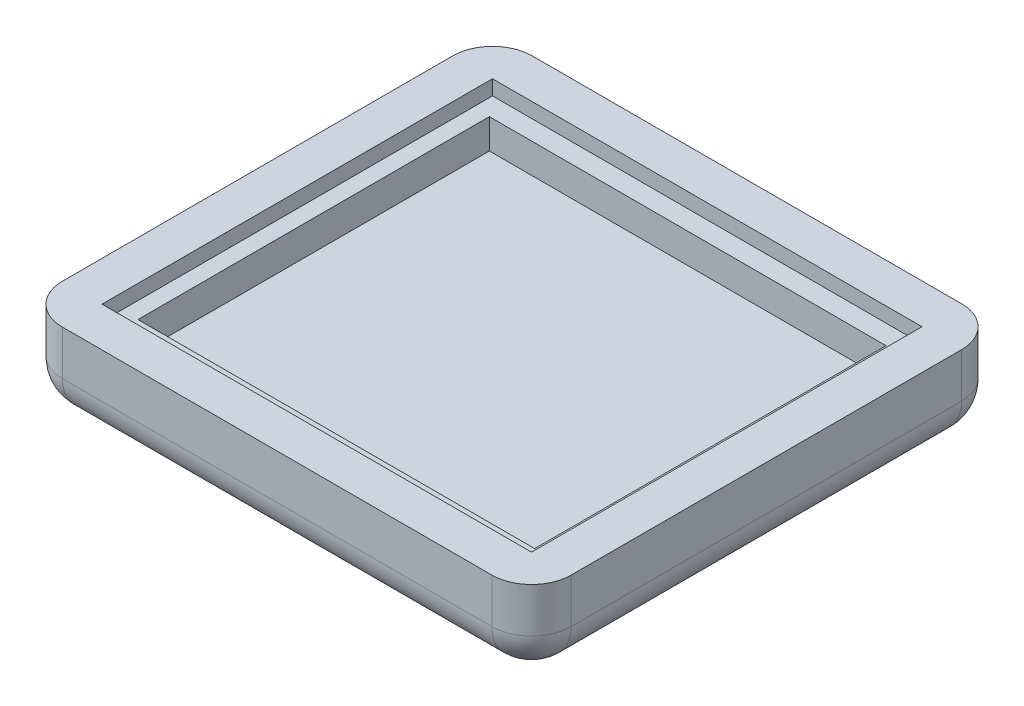
ISO-10303-21;
HEADER;
FILE_DESCRIPTION(('STEP AP214'),'2;1');
FILE_NAME('part.step','',(''),(''),'','','');
FILE_SCHEMA(('AUTOMOTIVE_DESIGN { 1 0 10303 214 1 1 1 1 }'));
ENDSEC;
DATA;
#1=APPLICATION_CONTEXT('core data for automotive mechanical design processes');
#2=APPLICATION_PROTOCOL_DEFINITION('international standard','automotive_design',2000,#1);
#3=PRODUCT_CONTEXT('',#1,'mechanical');
#4=PRODUCT('Part','Part','',(#3));
#5=PRODUCT_RELATED_PRODUCT_CATEGORY('part','',(#4));
#6=PRODUCT_DEFINITION_FORMATION('','',#4);
#7=PRODUCT_DEFINITION_CONTEXT('part definition',#1,'design');
#8=PRODUCT_DEFINITION('design','',#6,#7);
#9=PRODUCT_DEFINITION_SHAPE('','',#8);
#10=(LENGTH_UNIT() NAMED_UNIT(*) SI_UNIT(.MILLI.,.METRE.));
#11=(NAMED_UNIT(*) PLANE_ANGLE_UNIT() SI_UNIT($,.RADIAN.));
#12=(NAMED_UNIT(*) SI_UNIT($,.STERADIAN.) SOLID_ANGLE_UNIT());
#13=UNCERTAINTY_MEASURE_WITH_UNIT(LENGTH_MEASURE(1.E-05),#10,'distance_accuracy_value','');
#14=(GEOMETRIC_REPRESENTATION_CONTEXT(3) GLOBAL_UNCERTAINTY_ASSIGNED_CONTEXT((#13)) GLOBAL_UNIT_ASSIGNED_CONTEXT((#10,
#11,#12)) REPRESENTATION_CONTEXT('',''));
#15=CARTESIAN_POINT('',(0.,0.,0.));
#16=DIRECTION('',(0.,0.,1.));
#17=DIRECTION('',(1.,0.,0.));
#18=AXIS2_PLACEMENT_3D('',#15,#16,#17);
#19=CARTESIAN_POINT('',(0.,-5.715,0.));
#20=DIRECTION('',(0.,0.,1.));
#21=DIRECTION('',(1.,0.,0.));
#22=AXIS2_PLACEMENT_3D('',#19,#20,#21);
#23=PLANE('',#22);
#24=DIRECTION('',(1.,0.,0.));
#25=VECTOR('',#24,1.);
#26=CARTESIAN_POINT('',(55.,-1.905,0.));
#27=LINE('',#26,#25);
#28=CARTESIAN_POINT('',(0.,-1.905,0.));
#29=VERTEX_POINT('',#28);
#30=CARTESIAN_POINT('',(55.,-1.905,0.));
#31=VERTEX_POINT('',#30);
#32=EDGE_CURVE('E209',#29,#31,#27,.T.);
#33=ORIENTED_EDGE('',*,*,#32,.F.);
#34=DIRECTION('',(0.,1.,0.));
#35=VECTOR('',#34,1.);
#36=CARTESIAN_POINT('',(0.,-5.715,0.));
#37=LINE('',#36,#35);
#38=CARTESIAN_POINT('',(0.,0.,0.));
#39=VERTEX_POINT('',#38);
#40=EDGE_CURVE('E236',#29,#39,#37,.T.);
#41=ORIENTED_EDGE('',*,*,#40,.T.);
#42=DIRECTION('',(1.,0.,0.));
#43=VECTOR('',#42,1.);
#44=CARTESIAN_POINT('',(0.,0.,0.));
#45=LINE('',#44,#43);
#46=CARTESIAN_POINT('',(55.,0.,0.));
#47=VERTEX_POINT('',#46);
#48=EDGE_CURVE('E224',#39,#47,#45,.T.);
#49=ORIENTED_EDGE('',*,*,#48,.T.);
#50=DIRECTION('',(0.,1.,0.));
#51=VECTOR('',#50,1.);
#52=CARTESIAN_POINT('',(55.,-5.715,0.));
#53=LINE('',#52,#51);
#54=EDGE_CURVE('E237',#31,#47,#53,.T.);
#55=ORIENTED_EDGE('',*,*,#54,.F.);
#56=EDGE_LOOP('',(#33,#41,#49,#55));
#57=FACE_BOUND('',#56,.T.);
#58=ADVANCED_FACE('F37',(#57),#23,.F.);
#59=CARTESIAN_POINT('',(55.,-5.715,0.));
#60=DIRECTION('',(1.,0.,0.));
#61=DIRECTION('',(0.,0.,-1.));
#62=AXIS2_PLACEMENT_3D('',#59,#60,#61);
#63=PLANE('',#62);
#64=DIRECTION('',(0.,0.,-1.));
#65=VECTOR('',#64,1.);
#66=CARTESIAN_POINT('',(55.,-1.905,-50.));
#67=LINE('',#66,#65);
#68=CARTESIAN_POINT('',(55.,-1.905,-50.));
#69=VERTEX_POINT('',#68);
#70=EDGE_CURVE('E201',#31,#69,#67,.T.);
#71=ORIENTED_EDGE('',*,*,#70,.F.);
#72=ORIENTED_EDGE('',*,*,#54,.T.);
#73=DIRECTION('',(0.,0.,-1.));
#74=VECTOR('',#73,1.);
#75=CARTESIAN_POINT('',(55.,0.,0.));
#76=LINE('',#75,#74);
#77=CARTESIAN_POINT('',(55.,0.,-50.));
#78=VERTEX_POINT('',#77);
#79=EDGE_CURVE('E233',#47,#78,#76,.T.);
#80=ORIENTED_EDGE('',*,*,#79,.T.);
#81=DIRECTION('',(0.,1.,0.));
#82=VECTOR('',#81,1.);
#83=CARTESIAN_POINT('',(55.,-5.715,-50.));
#84=LINE('',#83,#82);
#85=EDGE_CURVE('E240',#69,#78,#84,.T.);
#86=ORIENTED_EDGE('',*,*,#85,.F.);
#87=EDGE_LOOP('',(#71,#72,#80,#86));
#88=FACE_BOUND('',#87,.T.);
#89=ADVANCED_FACE('F387',(#88),#63,.F.);
#90=CARTESIAN_POINT('',(0.,-5.715,-50.));
#91=DIRECTION('',(0.,0.,1.));
#92=DIRECTION('',(1.,0.,0.));
#93=AXIS2_PLACEMENT_3D('',#90,#91,#92);
#94=PLANE('',#93);
#95=DIRECTION('',(0.,1.,0.));
#96=VECTOR('',#95,1.);
#97=CARTESIAN_POINT('',(0.,-5.715,-50.));
#98=LINE('',#97,#96);
#99=CARTESIAN_POINT('',(0.,-1.905,-50.));
#100=VERTEX_POINT('',#99);
#101=CARTESIAN_POINT('',(0.,0.,-50.));
#102=VERTEX_POINT('',#101);
#103=EDGE_CURVE('E242',#100,#102,#98,.T.);
#104=ORIENTED_EDGE('',*,*,#103,.F.);
#105=DIRECTION('',(-1.,0.,0.));
#106=VECTOR('',#105,1.);
#107=CARTESIAN_POINT('',(55.,-1.905,-50.));
#108=LINE('',#107,#106);
#109=EDGE_CURVE('E62',#69,#100,#108,.T.);
#110=ORIENTED_EDGE('',*,*,#109,.F.);
#111=ORIENTED_EDGE('',*,*,#85,.T.);
#112=DIRECTION('',(1.,0.,0.));
#113=VECTOR('',#112,1.);
#114=CARTESIAN_POINT('',(0.,0.,-50.));
#115=LINE('',#114,#113);
#116=EDGE_CURVE('E230',#102,#78,#115,.T.);
#117=ORIENTED_EDGE('',*,*,#116,.F.);
#118=EDGE_LOOP('',(#104,#110,#111,#117));
#119=FACE_BOUND('',#118,.T.);
#120=ADVANCED_FACE('F393',(#119),#94,.T.);
#121=CARTESIAN_POINT('',(0.,-5.715,0.));
#122=DIRECTION('',(1.,0.,0.));
#123=DIRECTION('',(0.,0.,-1.));
#124=AXIS2_PLACEMENT_3D('',#121,#122,#123);
#125=PLANE('',#124);
#126=ORIENTED_EDGE('',*,*,#40,.F.);
#127=DIRECTION('',(0.,0.,1.));
#128=VECTOR('',#127,1.);
#129=CARTESIAN_POINT('',(0.,-1.905,-50.));
#130=LINE('',#129,#128);
#131=EDGE_CURVE('E207',#100,#29,#130,.T.);
#132=ORIENTED_EDGE('',*,*,#131,.F.);
#133=ORIENTED_EDGE('',*,*,#103,.T.);
#134=DIRECTION('',(0.,0.,-1.));
#135=VECTOR('',#134,1.);
#136=CARTESIAN_POINT('',(0.,0.,0.));
#137=LINE('',#136,#135);
#138=EDGE_CURVE('E227',#39,#102,#137,.T.);
#139=ORIENTED_EDGE('',*,*,#138,.F.);
#140=EDGE_LOOP('',(#126,#132,#133,#139));
#141=FACE_BOUND('',#140,.T.);
#142=ADVANCED_FACE('F399',(#141),#125,.T.);
#143=CARTESIAN_POINT('',(0.,-5.715,5.08));
#144=DIRECTION('',(0.,0.,-1.));
#145=DIRECTION('',(-1.,0.,0.));
#146=AXIS2_PLACEMENT_3D('',#143,#144,#145);
#147=PLANE('',#146);
#148=DIRECTION('',(-1.,0.,0.));
#149=VECTOR('',#148,1.);
#150=CARTESIAN_POINT('',(0.,0.,5.08));
#151=LINE('',#150,#149);
#152=CARTESIAN_POINT('',(55.,0.,5.07999999999998));
#153=VERTEX_POINT('',#152);
#154=CARTESIAN_POINT('',(0.,0.,5.08));
#155=VERTEX_POINT('',#154);
#156=EDGE_CURVE('E212',#153,#155,#151,.T.);
#157=ORIENTED_EDGE('',*,*,#156,.T.);
#158=DIRECTION('',(0.,1.,0.));
#159=VECTOR('',#158,1.);
#160=CARTESIAN_POINT('',(0.,-5.715,5.08));
#161=LINE('',#160,#159);
#162=CARTESIAN_POINT('',(0.,-5.715,5.08));
#163=VERTEX_POINT('',#162);
#164=EDGE_CURVE('E272',#155,#163,#161,.F.);
#165=ORIENTED_EDGE('',*,*,#164,.T.);
#166=DIRECTION('',(-1.,0.,0.));
#167=VECTOR('',#166,1.);
#168=CARTESIAN_POINT('',(0.,-5.715,5.08));
#169=LINE('',#168,#167);
#170=CARTESIAN_POINT('',(55.,-5.715,5.07999999999998));
#171=VERTEX_POINT('',#170);
#172=EDGE_CURVE('E270',#163,#171,#169,.F.);
#173=ORIENTED_EDGE('',*,*,#172,.T.);
#174=DIRECTION('',(0.,1.,0.));
#175=VECTOR('',#174,1.);
#176=CARTESIAN_POINT('',(55.,0.,5.07999999999998));
#177=LINE('',#176,#175);
#178=EDGE_CURVE('E268',#171,#153,#177,.T.);
#179=ORIENTED_EDGE('',*,*,#178,.T.);
#180=EDGE_LOOP('',(#157,#165,#173,#179));
#181=FACE_BOUND('',#180,.T.);
#182=ADVANCED_FACE('F378',(#181),#147,.F.);
#183=CARTESIAN_POINT('',(-5.08,-5.715,0.));
#184=DIRECTION('',(1.,0.,0.));
#185=DIRECTION('',(0.,0.,-1.));
#186=AXIS2_PLACEMENT_3D('',#183,#184,#185);
#187=PLANE('',#186);
#188=DIRECTION('',(0.,0.,-1.));
#189=VECTOR('',#188,1.);
#190=CARTESIAN_POINT('',(-5.08,-5.715,0.));
#191=LINE('',#190,#189);
#192=CARTESIAN_POINT('',(-5.08,-5.715,-50.));
#193=VERTEX_POINT('',#192);
#194=CARTESIAN_POINT('',(-5.08,-5.715,0.));
#195=VERTEX_POINT('',#194);
#196=EDGE_CURVE('E255',#193,#195,#191,.F.);
#197=ORIENTED_EDGE('',*,*,#196,.T.);
#198=DIRECTION('',(0.,1.,0.));
#199=VECTOR('',#198,1.);
#200=CARTESIAN_POINT('',(-5.08,-5.715,0.));
#201=LINE('',#200,#199);
#202=CARTESIAN_POINT('',(-5.08,0.,0.));
#203=VERTEX_POINT('',#202);
#204=EDGE_CURVE('E258',#195,#203,#201,.T.);
#205=ORIENTED_EDGE('',*,*,#204,.T.);
#206=DIRECTION('',(0.,0.,-1.));
#207=VECTOR('',#206,1.);
#208=CARTESIAN_POINT('',(-5.08,0.,0.));
#209=LINE('',#208,#207);
#210=CARTESIAN_POINT('',(-5.08,0.,-50.));
#211=VERTEX_POINT('',#210);
#212=EDGE_CURVE('E221',#203,#211,#209,.T.);
#213=ORIENTED_EDGE('',*,*,#212,.T.);
#214=DIRECTION('',(0.,1.,0.));
#215=VECTOR('',#214,1.);
#216=CARTESIAN_POINT('',(-5.08,-5.715,-50.));
#217=LINE('',#216,#215);
#218=EDGE_CURVE('E253',#211,#193,#217,.F.);
#219=ORIENTED_EDGE('',*,*,#218,.T.);
#220=EDGE_LOOP('',(#197,#205,#213,#219));
#221=FACE_BOUND('',#220,.T.);
#222=ADVANCED_FACE('F370',(#221),#187,.F.);
#223=CARTESIAN_POINT('',(0.,-5.715,-55.08));
#224=DIRECTION('',(0.,0.,1.));
#225=DIRECTION('',(1.,0.,0.));
#226=AXIS2_PLACEMENT_3D('',#223,#224,#225);
#227=PLANE('',#226);
#228=DIRECTION('',(1.,0.,0.));
#229=VECTOR('',#228,1.);
#230=CARTESIAN_POINT('',(0.,0.,-55.08));
#231=LINE('',#230,#229);
#232=CARTESIAN_POINT('',(0.,0.,-55.08));
#233=VERTEX_POINT('',#232);
#234=CARTESIAN_POINT('',(55.,0.,-55.08));
#235=VERTEX_POINT('',#234);
#236=EDGE_CURVE('E218',#233,#235,#231,.T.);
#237=ORIENTED_EDGE('',*,*,#236,.T.);
#238=DIRECTION('',(0.,1.,0.));
#239=VECTOR('',#238,1.);
#240=CARTESIAN_POINT('',(55.,-10.795,-55.08));
#241=LINE('',#240,#239);
#242=CARTESIAN_POINT('',(55.,-5.715,-55.08));
#243=VERTEX_POINT('',#242);
#244=EDGE_CURVE('E11',#235,#243,#241,.F.);
#245=ORIENTED_EDGE('',*,*,#244,.T.);
#246=DIRECTION('',(1.,0.,0.));
#247=VECTOR('',#246,1.);
#248=CARTESIAN_POINT('',(0.,-5.715,-55.08));
#249=LINE('',#248,#247);
#250=CARTESIAN_POINT('',(0.,-5.715,-55.08));
#251=VERTEX_POINT('',#250);
#252=EDGE_CURVE('E46',#243,#251,#249,.F.);
#253=ORIENTED_EDGE('',*,*,#252,.T.);
#254=DIRECTION('',(0.,1.,0.));
#255=VECTOR('',#254,1.);
#256=CARTESIAN_POINT('',(0.,-5.715,-55.08));
#257=LINE('',#256,#255);
#258=EDGE_CURVE('E280',#251,#233,#257,.T.);
#259=ORIENTED_EDGE('',*,*,#258,.T.);
#260=EDGE_LOOP('',(#237,#245,#253,#259));
#261=FACE_BOUND('',#260,.T.);
#262=ADVANCED_FACE('F353',(#261),#227,.F.);
#263=CARTESIAN_POINT('',(60.08,-5.715,0.));
#264=DIRECTION('',(1.,0.,0.));
#265=DIRECTION('',(0.,0.,-1.));
#266=AXIS2_PLACEMENT_3D('',#263,#264,#265);
#267=PLANE('',#266);
#268=DIRECTION('',(0.,0.,-1.));
#269=VECTOR('',#268,1.);
#270=CARTESIAN_POINT('',(60.08,0.,0.));
#271=LINE('',#270,#269);
#272=CARTESIAN_POINT('',(60.08,0.,0.));
#273=VERTEX_POINT('',#272);
#274=CARTESIAN_POINT('',(60.08,0.,-50.));
#275=VERTEX_POINT('',#274);
#276=EDGE_CURVE('E215',#273,#275,#271,.T.);
#277=ORIENTED_EDGE('',*,*,#276,.F.);
#278=DIRECTION('',(0.,1.,0.));
#279=VECTOR('',#278,1.);
#280=CARTESIAN_POINT('',(60.08,-10.795,0.));
#281=LINE('',#280,#279);
#282=CARTESIAN_POINT('',(60.08,-5.715,0.));
#283=VERTEX_POINT('',#282);
#284=EDGE_CURVE('E278',#273,#283,#281,.F.);
#285=ORIENTED_EDGE('',*,*,#284,.T.);
#286=DIRECTION('',(0.,0.,1.));
#287=VECTOR('',#286,1.);
#288=CARTESIAN_POINT('',(60.08,-5.715,-55.08));
#289=LINE('',#288,#287);
#290=CARTESIAN_POINT('',(60.08,-5.715,-50.));
#291=VERTEX_POINT('',#290);
#292=EDGE_CURVE('E276',#283,#291,#289,.F.);
#293=ORIENTED_EDGE('',*,*,#292,.T.);
#294=DIRECTION('',(0.,1.,0.));
#295=VECTOR('',#294,1.);
#296=CARTESIAN_POINT('',(60.08,0.,-50.));
#297=LINE('',#296,#295);
#298=EDGE_CURVE('E274',#291,#275,#297,.T.);
#299=ORIENTED_EDGE('',*,*,#298,.T.);
#300=EDGE_LOOP('',(#277,#285,#293,#299));
#301=FACE_BOUND('',#300,.T.);
#302=ADVANCED_FACE('F339',(#301),#267,.T.);
#303=CARTESIAN_POINT('',(0.,0.,0.));
#304=DIRECTION('',(0.,1.,0.));
#305=DIRECTION('',(0.,0.,1.));
#306=AXIS2_PLACEMENT_3D('',#303,#304,#305);
#307=PLANE('',#306);
#308=ORIENTED_EDGE('',*,*,#212,.F.);
#309=CARTESIAN_POINT('',(0.,0.,0.));
#310=DIRECTION('',(0.,1.,0.));
#311=DIRECTION('',(0.,0.,1.));
#312=AXIS2_PLACEMENT_3D('',#309,#310,#311);
#313=CIRCLE('',#312,5.08);
#314=EDGE_CURVE('E266',#203,#155,#313,.T.);
#315=ORIENTED_EDGE('',*,*,#314,.T.);
#316=ORIENTED_EDGE('',*,*,#156,.F.);
#317=CARTESIAN_POINT('',(55.,0.,0.));
#318=DIRECTION('',(0.,1.,0.));
#319=DIRECTION('',(0.,0.,1.));
#320=AXIS2_PLACEMENT_3D('',#317,#318,#319);
#321=CIRCLE('',#320,5.08);
#322=EDGE_CURVE('E264',#153,#273,#321,.T.);
#323=ORIENTED_EDGE('',*,*,#322,.T.);
#324=ORIENTED_EDGE('',*,*,#276,.T.);
#325=CARTESIAN_POINT('',(55.,0.,-50.));
#326=DIRECTION('',(0.,1.,0.));
#327=DIRECTION('',(0.,0.,1.));
#328=AXIS2_PLACEMENT_3D('',#325,#326,#327);
#329=CIRCLE('',#328,5.08);
#330=EDGE_CURVE('E262',#275,#235,#329,.T.);
#331=ORIENTED_EDGE('',*,*,#330,.T.);
#332=ORIENTED_EDGE('',*,*,#236,.F.);
#333=CARTESIAN_POINT('',(0.,0.,-50.));
#334=DIRECTION('',(0.,1.,0.));
#335=DIRECTION('',(0.,0.,1.));
#336=AXIS2_PLACEMENT_3D('',#333,#334,#335);
#337=CIRCLE('',#336,5.08);
#338=EDGE_CURVE('E260',#233,#211,#337,.T.);
#339=ORIENTED_EDGE('',*,*,#338,.T.);
#340=EDGE_LOOP('',(#308,#315,#316,#323,#324,#331,#332,#339));
#341=FACE_BOUND('',#340,.T.);
#342=ORIENTED_EDGE('',*,*,#48,.F.);
#343=ORIENTED_EDGE('',*,*,#138,.T.);
#344=ORIENTED_EDGE('',*,*,#116,.T.);
#345=ORIENTED_EDGE('',*,*,#79,.F.);
#346=EDGE_LOOP('',(#342,#343,#344,#345));
#347=FACE_BOUND('',#346,.T.);
#348=ADVANCED_FACE('F349',(#341,#347),#307,.T.);
#349=CARTESIAN_POINT('',(0.,-10.795,0.));
#350=DIRECTION('',(0.,1.,0.));
#351=DIRECTION('',(0.,0.,1.));
#352=AXIS2_PLACEMENT_3D('',#349,#350,#351);
#353=PLANE('',#352);
#354=DIRECTION('',(-1.,0.,0.));
#355=VECTOR('',#354,1.);
#356=CARTESIAN_POINT('',(0.,-10.795,0.));
#357=LINE('',#356,#355);
#358=CARTESIAN_POINT('',(55.,-10.795,0.));
#359=VERTEX_POINT('',#358);
#360=CARTESIAN_POINT('',(0.,-10.795,0.));
#361=VERTEX_POINT('',#360);
#362=EDGE_CURVE('E248',#359,#361,#357,.T.);
#363=ORIENTED_EDGE('',*,*,#362,.T.);
#364=DIRECTION('',(0.,0.,-1.));
#365=VECTOR('',#364,1.);
#366=CARTESIAN_POINT('',(0.,-10.795,0.));
#367=LINE('',#366,#365);
#368=CARTESIAN_POINT('',(0.,-10.795,-50.));
#369=VERTEX_POINT('',#368);
#370=EDGE_CURVE('E250',#361,#369,#367,.T.);
#371=ORIENTED_EDGE('',*,*,#370,.T.);
#372=DIRECTION('',(1.,0.,0.));
#373=VECTOR('',#372,1.);
#374=CARTESIAN_POINT('',(0.,-10.795,-50.));
#375=LINE('',#374,#373);
#376=CARTESIAN_POINT('',(55.,-10.795,-50.));
#377=VERTEX_POINT('',#376);
#378=EDGE_CURVE('E239',#369,#377,#375,.T.);
#379=ORIENTED_EDGE('',*,*,#378,.T.);
#380=DIRECTION('',(0.,0.,1.));
#381=VECTOR('',#380,1.);
#382=CARTESIAN_POINT('',(55.,-10.795,5.08));
#383=LINE('',#382,#381);
#384=EDGE_CURVE('E246',#377,#359,#383,.T.);
#385=ORIENTED_EDGE('',*,*,#384,.T.);
#386=EDGE_LOOP('',(#363,#371,#379,#385));
#387=FACE_BOUND('',#386,.T.);
#388=ADVANCED_FACE('F328',(#387),#353,.F.);
#389=CARTESIAN_POINT('',(55.,-5.715,0.));
#390=DIRECTION('',(0.,-1.,0.));
#391=DIRECTION('',(0.,0.,-1.));
#392=AXIS2_PLACEMENT_3D('',#389,#390,#391);
#393=CYLINDRICAL_SURFACE('',#392,5.08);
#394=ORIENTED_EDGE('',*,*,#322,.F.);
#395=ORIENTED_EDGE('',*,*,#178,.F.);
#396=CARTESIAN_POINT('',(55.,-5.715,0.));
#397=DIRECTION('',(0.,-1.,0.));
#398=DIRECTION('',(0.,0.,-1.));
#399=AXIS2_PLACEMENT_3D('',#396,#397,#398);
#400=CIRCLE('',#399,5.08);
#401=EDGE_CURVE('E41',#283,#171,#400,.T.);
#402=ORIENTED_EDGE('',*,*,#401,.F.);
#403=ORIENTED_EDGE('',*,*,#284,.F.);
#404=EDGE_LOOP('',(#394,#395,#402,#403));
#405=FACE_BOUND('',#404,.T.);
#406=ADVANCED_FACE('F39',(#405),#393,.T.);
#407=CARTESIAN_POINT('',(55.,-5.715,0.));
#408=DIRECTION('',(0.,0.,-1.));
#409=DIRECTION('',(-1.,0.,0.));
#410=AXIS2_PLACEMENT_3D('',#407,#408,#409);
#411=CYLINDRICAL_SURFACE('',#410,5.08);
#412=CARTESIAN_POINT('',(55.,-5.715,-50.));
#413=DIRECTION('',(0.,0.,-1.));
#414=DIRECTION('',(-1.,0.,0.));
#415=AXIS2_PLACEMENT_3D('',#412,#413,#414);
#416=CIRCLE('',#415,5.08);
#417=EDGE_CURVE('E307',#291,#377,#416,.T.);
#418=ORIENTED_EDGE('',*,*,#417,.F.);
#419=ORIENTED_EDGE('',*,*,#292,.F.);
#420=CARTESIAN_POINT('',(55.,-5.715,0.));
#421=DIRECTION('',(0.,0.,1.));
#422=DIRECTION('',(1.,0.,0.));
#423=AXIS2_PLACEMENT_3D('',#420,#421,#422);
#424=CIRCLE('',#423,5.08);
#425=EDGE_CURVE('E309',#359,#283,#424,.T.);
#426=ORIENTED_EDGE('',*,*,#425,.F.);
#427=ORIENTED_EDGE('',*,*,#384,.F.);
#428=EDGE_LOOP('',(#418,#419,#426,#427));
#429=FACE_BOUND('',#428,.T.);
#430=ADVANCED_FACE('F335',(#429),#411,.T.);
#431=CARTESIAN_POINT('',(55.,-5.715,-50.));
#432=DIRECTION('',(0.,-1.,0.));
#433=DIRECTION('',(0.,0.,-1.));
#434=AXIS2_PLACEMENT_3D('',#431,#432,#433);
#435=CYLINDRICAL_SURFACE('',#434,5.08);
#436=ORIENTED_EDGE('',*,*,#330,.F.);
#437=ORIENTED_EDGE('',*,*,#298,.F.);
#438=CARTESIAN_POINT('',(55.,-5.715,-50.));
#439=DIRECTION('',(0.,-1.,0.));
#440=DIRECTION('',(0.,0.,-1.));
#441=AXIS2_PLACEMENT_3D('',#438,#439,#440);
#442=CIRCLE('',#441,5.08);
#443=EDGE_CURVE('E304',#243,#291,#442,.T.);
#444=ORIENTED_EDGE('',*,*,#443,.F.);
#445=ORIENTED_EDGE('',*,*,#244,.F.);
#446=EDGE_LOOP('',(#436,#437,#444,#445));
#447=FACE_BOUND('',#446,.T.);
#448=ADVANCED_FACE('F343',(#447),#435,.T.);
#449=CARTESIAN_POINT('',(55.,-5.715,0.));
#450=DIRECTION('',(0.,0.,1.));
#451=DIRECTION('',(1.,0.,0.));
#452=AXIS2_PLACEMENT_3D('',#449,#450,#451);
#453=SPHERICAL_SURFACE('',#452,5.08);
#454=ORIENTED_EDGE('',*,*,#425,.T.);
#455=ORIENTED_EDGE('',*,*,#401,.T.);
#456=CARTESIAN_POINT('',(55.,-5.715,0.));
#457=DIRECTION('',(1.,0.,0.));
#458=DIRECTION('',(0.,0.,-1.));
#459=AXIS2_PLACEMENT_3D('',#456,#457,#458);
#460=CIRCLE('',#459,5.08);
#461=EDGE_CURVE('E301',#359,#171,#460,.F.);
#462=ORIENTED_EDGE('',*,*,#461,.F.);
#463=EDGE_LOOP('',(#454,#455,#462));
#464=FACE_BOUND('',#463,.T.);
#465=ADVANCED_FACE('F316',(#464),#453,.T.);
#466=CARTESIAN_POINT('',(55.,-5.715,-50.));
#467=DIRECTION('',(0.,0.,1.));
#468=DIRECTION('',(1.,0.,0.));
#469=AXIS2_PLACEMENT_3D('',#466,#467,#468);
#470=SPHERICAL_SURFACE('',#469,5.08);
#471=ORIENTED_EDGE('',*,*,#443,.T.);
#472=ORIENTED_EDGE('',*,*,#417,.T.);
#473=CARTESIAN_POINT('',(55.,-5.715,-50.));
#474=DIRECTION('',(1.,0.,0.));
#475=DIRECTION('',(0.,0.,-1.));
#476=AXIS2_PLACEMENT_3D('',#473,#474,#475);
#477=CIRCLE('',#476,5.08);
#478=EDGE_CURVE('E298',#243,#377,#477,.F.);
#479=ORIENTED_EDGE('',*,*,#478,.F.);
#480=EDGE_LOOP('',(#471,#472,#479));
#481=FACE_BOUND('',#480,.T.);
#482=ADVANCED_FACE('F426',(#481),#470,.T.);
#483=CARTESIAN_POINT('',(0.,-5.715,0.));
#484=DIRECTION('',(0.,1.,0.));
#485=DIRECTION('',(0.,0.,1.));
#486=AXIS2_PLACEMENT_3D('',#483,#484,#485);
#487=CYLINDRICAL_SURFACE('',#486,5.08);
#488=ORIENTED_EDGE('',*,*,#314,.F.);
#489=ORIENTED_EDGE('',*,*,#204,.F.);
#490=CARTESIAN_POINT('',(0.,-5.715,0.));
#491=DIRECTION('',(0.,-1.,0.));
#492=DIRECTION('',(0.,0.,-1.));
#493=AXIS2_PLACEMENT_3D('',#490,#491,#492);
#494=CIRCLE('',#493,5.08);
#495=EDGE_CURVE('E295',#163,#195,#494,.T.);
#496=ORIENTED_EDGE('',*,*,#495,.F.);
#497=ORIENTED_EDGE('',*,*,#164,.F.);
#498=EDGE_LOOP('',(#488,#489,#496,#497));
#499=FACE_BOUND('',#498,.T.);
#500=ADVANCED_FACE('F376',(#499),#487,.T.);
#501=CARTESIAN_POINT('',(0.,-5.715,0.));
#502=DIRECTION('',(-1.,0.,0.));
#503=DIRECTION('',(0.,0.,1.));
#504=AXIS2_PLACEMENT_3D('',#501,#502,#503);
#505=CYLINDRICAL_SURFACE('',#504,5.08);
#506=ORIENTED_EDGE('',*,*,#461,.T.);
#507=ORIENTED_EDGE('',*,*,#172,.F.);
#508=CARTESIAN_POINT('',(0.,-5.715,0.));
#509=DIRECTION('',(-1.,0.,0.));
#510=DIRECTION('',(0.,0.,1.));
#511=AXIS2_PLACEMENT_3D('',#508,#509,#510);
#512=CIRCLE('',#511,5.08);
#513=EDGE_CURVE('E292',#361,#163,#512,.T.);
#514=ORIENTED_EDGE('',*,*,#513,.F.);
#515=ORIENTED_EDGE('',*,*,#362,.F.);
#516=EDGE_LOOP('',(#506,#507,#514,#515));
#517=FACE_BOUND('',#516,.T.);
#518=ADVANCED_FACE('F323',(#517),#505,.T.);
#519=CARTESIAN_POINT('',(0.,-5.715,-50.));
#520=DIRECTION('',(1.,0.,0.));
#521=DIRECTION('',(0.,0.,-1.));
#522=AXIS2_PLACEMENT_3D('',#519,#520,#521);
#523=CYLINDRICAL_SURFACE('',#522,5.08);
#524=ORIENTED_EDGE('',*,*,#478,.T.);
#525=ORIENTED_EDGE('',*,*,#378,.F.);
#526=CARTESIAN_POINT('',(0.,-5.715,-50.));
#527=DIRECTION('',(-1.,0.,0.));
#528=DIRECTION('',(0.,0.,1.));
#529=AXIS2_PLACEMENT_3D('',#526,#527,#528);
#530=CIRCLE('',#529,5.08);
#531=EDGE_CURVE('E289',#251,#369,#530,.T.);
#532=ORIENTED_EDGE('',*,*,#531,.F.);
#533=ORIENTED_EDGE('',*,*,#252,.F.);
#534=EDGE_LOOP('',(#524,#525,#532,#533));
#535=FACE_BOUND('',#534,.T.);
#536=ADVANCED_FACE('F363',(#535),#523,.T.);
#537=CARTESIAN_POINT('',(0.,-5.715,-50.));
#538=DIRECTION('',(0.,1.,0.));
#539=DIRECTION('',(0.,0.,1.));
#540=AXIS2_PLACEMENT_3D('',#537,#538,#539);
#541=CYLINDRICAL_SURFACE('',#540,5.08);
#542=ORIENTED_EDGE('',*,*,#338,.F.);
#543=ORIENTED_EDGE('',*,*,#258,.F.);
#544=CARTESIAN_POINT('',(0.,-5.715,-50.));
#545=DIRECTION('',(0.,-1.,0.));
#546=DIRECTION('',(0.,0.,-1.));
#547=AXIS2_PLACEMENT_3D('',#544,#545,#546);
#548=CIRCLE('',#547,5.08);
#549=EDGE_CURVE('E286',#193,#251,#548,.T.);
#550=ORIENTED_EDGE('',*,*,#549,.F.);
#551=ORIENTED_EDGE('',*,*,#218,.F.);
#552=EDGE_LOOP('',(#542,#543,#550,#551));
#553=FACE_BOUND('',#552,.T.);
#554=ADVANCED_FACE('F359',(#553),#541,.T.);
#555=CARTESIAN_POINT('',(0.,-5.715,0.));
#556=DIRECTION('',(0.,0.,1.));
#557=DIRECTION('',(1.,0.,0.));
#558=AXIS2_PLACEMENT_3D('',#555,#556,#557);
#559=SPHERICAL_SURFACE('',#558,5.08);
#560=ORIENTED_EDGE('',*,*,#513,.T.);
#561=ORIENTED_EDGE('',*,*,#495,.T.);
#562=CARTESIAN_POINT('',(0.,-5.715,0.));
#563=DIRECTION('',(0.,0.,1.));
#564=DIRECTION('',(1.,0.,0.));
#565=AXIS2_PLACEMENT_3D('',#562,#563,#564);
#566=CIRCLE('',#565,5.08);
#567=EDGE_CURVE('E284',#361,#195,#566,.F.);
#568=ORIENTED_EDGE('',*,*,#567,.F.);
#569=EDGE_LOOP('',(#560,#561,#568));
#570=FACE_BOUND('',#569,.T.);
#571=ADVANCED_FACE('F414',(#570),#559,.T.);
#572=CARTESIAN_POINT('',(0.,-5.715,-50.));
#573=DIRECTION('',(0.,0.,1.));
#574=DIRECTION('',(1.,0.,0.));
#575=AXIS2_PLACEMENT_3D('',#572,#573,#574);
#576=SPHERICAL_SURFACE('',#575,5.08);
#577=ORIENTED_EDGE('',*,*,#549,.T.);
#578=ORIENTED_EDGE('',*,*,#531,.T.);
#579=CARTESIAN_POINT('',(0.,-5.715,-50.));
#580=DIRECTION('',(0.,0.,-1.));
#581=DIRECTION('',(-1.,0.,0.));
#582=AXIS2_PLACEMENT_3D('',#579,#580,#581);
#583=CIRCLE('',#582,5.08);
#584=EDGE_CURVE('E211',#193,#369,#583,.F.);
#585=ORIENTED_EDGE('',*,*,#584,.F.);
#586=EDGE_LOOP('',(#577,#578,#585));
#587=FACE_BOUND('',#586,.T.);
#588=ADVANCED_FACE('F366',(#587),#576,.T.);
#589=CARTESIAN_POINT('',(0.,-5.715,0.));
#590=DIRECTION('',(0.,0.,-1.));
#591=DIRECTION('',(-1.,0.,0.));
#592=AXIS2_PLACEMENT_3D('',#589,#590,#591);
#593=CYLINDRICAL_SURFACE('',#592,5.08);
#594=ORIENTED_EDGE('',*,*,#567,.T.);
#595=ORIENTED_EDGE('',*,*,#196,.F.);
#596=ORIENTED_EDGE('',*,*,#584,.T.);
#597=ORIENTED_EDGE('',*,*,#370,.F.);
#598=EDGE_LOOP('',(#594,#595,#596,#597));
#599=FACE_BOUND('',#598,.T.);
#600=ADVANCED_FACE('F368',(#599),#593,.T.);
#601=CARTESIAN_POINT('',(0.,-1.905,0.));
#602=DIRECTION('',(0.,-1.,0.));
#603=DIRECTION('',(0.,0.,-1.));
#604=AXIS2_PLACEMENT_3D('',#601,#602,#603);
#605=PLANE('',#604);
#606=DIRECTION('',(1.,0.,0.));
#607=VECTOR('',#606,1.);
#608=CARTESIAN_POINT('',(0.,-1.905,-2.49999999999999));
#609=LINE('',#608,#607);
#610=CARTESIAN_POINT('',(2.1,-1.905,-2.49999999999999));
#611=VERTEX_POINT('',#610);
#612=CARTESIAN_POINT('',(52.9,-1.905,-2.49999999999999));
#613=VERTEX_POINT('',#612);
#614=EDGE_CURVE('E194',#611,#613,#609,.T.);
#615=ORIENTED_EDGE('',*,*,#614,.F.);
#616=DIRECTION('',(0.,0.,-1.));
#617=VECTOR('',#616,1.);
#618=CARTESIAN_POINT('',(2.1,-1.905,0.));
#619=LINE('',#618,#617);
#620=CARTESIAN_POINT('',(2.1,-1.905,-47.5));
#621=VERTEX_POINT('',#620);
#622=EDGE_CURVE('E171',#611,#621,#619,.T.);
#623=ORIENTED_EDGE('',*,*,#622,.T.);
#624=DIRECTION('',(1.,0.,0.));
#625=VECTOR('',#624,1.);
#626=CARTESIAN_POINT('',(0.,-1.905,-47.5));
#627=LINE('',#626,#625);
#628=CARTESIAN_POINT('',(52.9,-1.905,-47.5));
#629=VERTEX_POINT('',#628);
#630=EDGE_CURVE('E184',#621,#629,#627,.T.);
#631=ORIENTED_EDGE('',*,*,#630,.T.);
#632=DIRECTION('',(0.,0.,-1.));
#633=VECTOR('',#632,1.);
#634=CARTESIAN_POINT('',(52.9,-1.905,0.));
#635=LINE('',#634,#633);
#636=EDGE_CURVE('E54',#613,#629,#635,.T.);
#637=ORIENTED_EDGE('',*,*,#636,.F.);
#638=EDGE_LOOP('',(#615,#623,#631,#637));
#639=FACE_BOUND('',#638,.T.);
#640=ORIENTED_EDGE('',*,*,#70,.T.);
#641=ORIENTED_EDGE('',*,*,#109,.T.);
#642=ORIENTED_EDGE('',*,*,#131,.T.);
#643=ORIENTED_EDGE('',*,*,#32,.T.);
#644=EDGE_LOOP('',(#640,#641,#642,#643));
#645=FACE_BOUND('',#644,.T.);
#646=ADVANCED_FACE('F411',(#639,#645),#605,.F.);
#647=CARTESIAN_POINT('',(2.1,-5.715,0.));
#648=DIRECTION('',(1.,0.,0.));
#649=DIRECTION('',(0.,0.,-1.));
#650=AXIS2_PLACEMENT_3D('',#647,#648,#649);
#651=PLANE('',#650);
#652=ORIENTED_EDGE('',*,*,#622,.F.);
#653=DIRECTION('',(0.,1.,0.));
#654=VECTOR('',#653,1.);
#655=CARTESIAN_POINT('',(2.1,-5.715,-2.49999999999999));
#656=LINE('',#655,#654);
#657=CARTESIAN_POINT('',(2.1,-5.715,-2.49999999999999));
#658=VERTEX_POINT('',#657);
#659=EDGE_CURVE('E164',#658,#611,#656,.T.);
#660=ORIENTED_EDGE('',*,*,#659,.F.);
#661=DIRECTION('',(0.,0.,-1.));
#662=VECTOR('',#661,1.);
#663=CARTESIAN_POINT('',(2.1,-5.715,0.));
#664=LINE('',#663,#662);
#665=CARTESIAN_POINT('',(2.1,-5.715,-47.5));
#666=VERTEX_POINT('',#665);
#667=EDGE_CURVE('E168',#658,#666,#664,.T.);
#668=ORIENTED_EDGE('',*,*,#667,.T.);
#669=DIRECTION('',(0.,1.,0.));
#670=VECTOR('',#669,1.);
#671=CARTESIAN_POINT('',(2.1,-5.715,-47.5));
#672=LINE('',#671,#670);
#673=EDGE_CURVE('E199',#666,#621,#672,.T.);
#674=ORIENTED_EDGE('',*,*,#673,.T.);
#675=EDGE_LOOP('',(#652,#660,#668,#674));
#676=FACE_BOUND('',#675,.T.);
#677=ADVANCED_FACE('F166',(#676),#651,.T.);
#678=CARTESIAN_POINT('',(0.,-5.715,-47.5));
#679=DIRECTION('',(0.,0.,1.));
#680=DIRECTION('',(1.,0.,0.));
#681=AXIS2_PLACEMENT_3D('',#678,#679,#680);
#682=PLANE('',#681);
#683=ORIENTED_EDGE('',*,*,#630,.F.);
#684=ORIENTED_EDGE('',*,*,#673,.F.);
#685=DIRECTION('',(1.,0.,0.));
#686=VECTOR('',#685,1.);
#687=CARTESIAN_POINT('',(0.,-5.715,-47.5));
#688=LINE('',#687,#686);
#689=CARTESIAN_POINT('',(52.9,-5.715,-47.5));
#690=VERTEX_POINT('',#689);
#691=EDGE_CURVE('E177',#666,#690,#688,.T.);
#692=ORIENTED_EDGE('',*,*,#691,.T.);
#693=DIRECTION('',(0.,1.,0.));
#694=VECTOR('',#693,1.);
#695=CARTESIAN_POINT('',(52.9,-5.715,-47.5));
#696=LINE('',#695,#694);
#697=EDGE_CURVE('E202',#690,#629,#696,.T.);
#698=ORIENTED_EDGE('',*,*,#697,.T.);
#699=EDGE_LOOP('',(#683,#684,#692,#698));
#700=FACE_BOUND('',#699,.T.);
#701=ADVANCED_FACE('F487',(#700),#682,.T.);
#702=CARTESIAN_POINT('',(52.9,-5.715,0.));
#703=DIRECTION('',(1.,0.,0.));
#704=DIRECTION('',(0.,0.,-1.));
#705=AXIS2_PLACEMENT_3D('',#702,#703,#704);
#706=PLANE('',#705);
#707=ORIENTED_EDGE('',*,*,#636,.T.);
#708=ORIENTED_EDGE('',*,*,#697,.F.);
#709=DIRECTION('',(0.,0.,-1.));
#710=VECTOR('',#709,1.);
#711=CARTESIAN_POINT('',(52.9,-5.715,0.));
#712=LINE('',#711,#710);
#713=CARTESIAN_POINT('',(52.9,-5.715,-2.49999999999999));
#714=VERTEX_POINT('',#713);
#715=EDGE_CURVE('E188',#714,#690,#712,.T.);
#716=ORIENTED_EDGE('',*,*,#715,.F.);
#717=DIRECTION('',(0.,1.,0.));
#718=VECTOR('',#717,1.);
#719=CARTESIAN_POINT('',(52.9,-5.715,-2.49999999999999));
#720=LINE('',#719,#718);
#721=EDGE_CURVE('E176',#714,#613,#720,.T.);
#722=ORIENTED_EDGE('',*,*,#721,.T.);
#723=EDGE_LOOP('',(#707,#708,#716,#722));
#724=FACE_BOUND('',#723,.T.);
#725=ADVANCED_FACE('F494',(#724),#706,.F.);
#726=CARTESIAN_POINT('',(0.,-5.715,-2.49999999999999));
#727=DIRECTION('',(0.,0.,1.));
#728=DIRECTION('',(1.,0.,0.));
#729=AXIS2_PLACEMENT_3D('',#726,#727,#728);
#730=PLANE('',#729);
#731=ORIENTED_EDGE('',*,*,#614,.T.);
#732=ORIENTED_EDGE('',*,*,#721,.F.);
#733=DIRECTION('',(1.,0.,0.));
#734=VECTOR('',#733,1.);
#735=CARTESIAN_POINT('',(0.,-5.715,-2.49999999999999));
#736=LINE('',#735,#734);
#737=EDGE_CURVE('E183',#658,#714,#736,.T.);
#738=ORIENTED_EDGE('',*,*,#737,.F.);
#739=ORIENTED_EDGE('',*,*,#659,.T.);
#740=EDGE_LOOP('',(#731,#732,#738,#739));
#741=FACE_BOUND('',#740,.T.);
#742=ADVANCED_FACE('F186',(#741),#730,.F.);
#743=CARTESIAN_POINT('',(0.,-5.715,0.));
#744=DIRECTION('',(0.,1.,0.));
#745=DIRECTION('',(0.,0.,1.));
#746=AXIS2_PLACEMENT_3D('',#743,#744,#745);
#747=PLANE('',#746);
#748=ORIENTED_EDGE('',*,*,#667,.F.);
#749=ORIENTED_EDGE('',*,*,#737,.T.);
#750=ORIENTED_EDGE('',*,*,#715,.T.);
#751=ORIENTED_EDGE('',*,*,#691,.F.);
#752=EDGE_LOOP('',(#748,#749,#750,#751));
#753=FACE_BOUND('',#752,.T.);
#754=ADVANCED_FACE('F181',(#753),#747,.T.);
#755=CLOSED_SHELL('',(#58,#89,#120,#142,#182,#222,#262,#302,#348,#388,#406,#430,#448,#465,#482,
#500,#518,#536,#554,#571,#588,#600,#646,#677,#701,#725,#742,#754));
#756=MANIFOLD_SOLID_BREP('B2',#755);
#757=ADVANCED_BREP_SHAPE_REPRESENTATION('',(#18,#756),#14);
#758=SHAPE_DEFINITION_REPRESENTATION(#9,#757);
ENDSEC;
END-ISO-10303-21;
